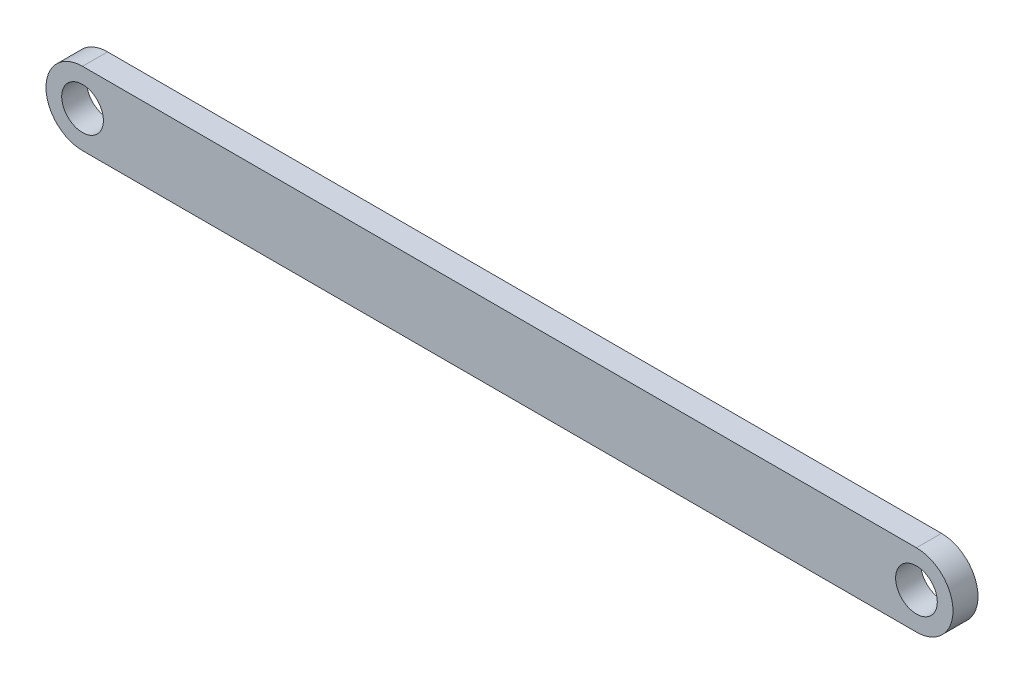
ISO-10303-21;
HEADER;
FILE_DESCRIPTION(('STEP AP214'),'2;1');
FILE_NAME('part.step','',(''),(''),'','','');
FILE_SCHEMA(('AUTOMOTIVE_DESIGN { 1 0 10303 214 1 1 1 1 }'));
ENDSEC;
DATA;
#1=APPLICATION_CONTEXT('core data for automotive mechanical design processes');
#2=APPLICATION_PROTOCOL_DEFINITION('international standard','automotive_design',2000,#1);
#3=PRODUCT_CONTEXT('',#1,'mechanical');
#4=PRODUCT('Part','Part','',(#3));
#5=PRODUCT_RELATED_PRODUCT_CATEGORY('part','',(#4));
#6=PRODUCT_DEFINITION_FORMATION('','',#4);
#7=PRODUCT_DEFINITION_CONTEXT('part definition',#1,'design');
#8=PRODUCT_DEFINITION('design','',#6,#7);
#9=PRODUCT_DEFINITION_SHAPE('','',#8);
#10=(LENGTH_UNIT() NAMED_UNIT(*) SI_UNIT(.MILLI.,.METRE.));
#11=(NAMED_UNIT(*) PLANE_ANGLE_UNIT() SI_UNIT($,.RADIAN.));
#12=(NAMED_UNIT(*) SI_UNIT($,.STERADIAN.) SOLID_ANGLE_UNIT());
#13=UNCERTAINTY_MEASURE_WITH_UNIT(LENGTH_MEASURE(1.E-05),#10,'distance_accuracy_value','');
#14=(GEOMETRIC_REPRESENTATION_CONTEXT(3) GLOBAL_UNCERTAINTY_ASSIGNED_CONTEXT((#13)) GLOBAL_UNIT_ASSIGNED_CONTEXT((#10,
#11,#12)) REPRESENTATION_CONTEXT('',''));
#15=CARTESIAN_POINT('',(0.,0.,0.));
#16=DIRECTION('',(0.,0.,1.));
#17=DIRECTION('',(1.,0.,0.));
#18=AXIS2_PLACEMENT_3D('',#15,#16,#17);
#19=CARTESIAN_POINT('',(-32.6751534027403,0.,6.));
#20=DIRECTION('',(0.,0.,1.));
#21=DIRECTION('',(1.,0.,0.));
#22=AXIS2_PLACEMENT_3D('',#19,#20,#21);
#23=PLANE('',#22);
#24=CARTESIAN_POINT('',(-32.6751534027403,0.,6.));
#25=DIRECTION('',(0.,0.,1.));
#26=DIRECTION('',(1.,0.,0.));
#27=AXIS2_PLACEMENT_3D('',#24,#25,#26);
#28=CIRCLE('',#27,5.);
#29=CARTESIAN_POINT('',(-27.6751534027403,0.,6.));
#30=VERTEX_POINT('',#29);
#31=EDGE_CURVE('E112',#30,#30,#28,.T.);
#32=ORIENTED_EDGE('',*,*,#31,.F.);
#33=EDGE_LOOP('',(#32));
#34=FACE_BOUND('',#33,.T.);
#35=CARTESIAN_POINT('',(-32.6751534027403,0.,6.));
#36=DIRECTION('',(0.,0.,1.));
#37=DIRECTION('',(1.,0.,0.));
#38=AXIS2_PLACEMENT_3D('',#35,#36,#37);
#39=CIRCLE('',#38,8.76308330597177);
#40=CARTESIAN_POINT('',(-32.6751534027403,8.76308330597177,6.));
#41=VERTEX_POINT('',#40);
#42=CARTESIAN_POINT('',(-32.6751534027403,-8.76308330597177,6.));
#43=VERTEX_POINT('',#42);
#44=EDGE_CURVE('E92',#41,#43,#39,.T.);
#45=ORIENTED_EDGE('',*,*,#44,.T.);
#46=DIRECTION('',(1.,0.,0.));
#47=VECTOR('',#46,1.);
#48=CARTESIAN_POINT('',(-32.6751534027403,-8.76308330597177,6.));
#49=LINE('',#48,#47);
#50=CARTESIAN_POINT('',(167.32484659726,-8.76308330597177,6.));
#51=VERTEX_POINT('',#50);
#52=EDGE_CURVE('E87',#43,#51,#49,.T.);
#53=ORIENTED_EDGE('',*,*,#52,.T.);
#54=CARTESIAN_POINT('',(167.32484659726,0.,6.));
#55=DIRECTION('',(0.,0.,1.));
#56=DIRECTION('',(1.,0.,0.));
#57=AXIS2_PLACEMENT_3D('',#54,#55,#56);
#58=CIRCLE('',#57,8.76308330597177);
#59=CARTESIAN_POINT('',(167.32484659726,8.76308330597177,6.));
#60=VERTEX_POINT('',#59);
#61=EDGE_CURVE('E90',#51,#60,#58,.T.);
#62=ORIENTED_EDGE('',*,*,#61,.T.);
#63=DIRECTION('',(-1.,0.,0.));
#64=VECTOR('',#63,1.);
#65=CARTESIAN_POINT('',(-32.6751534027403,8.76308330597177,6.));
#66=LINE('',#65,#64);
#67=EDGE_CURVE('E57',#60,#41,#66,.T.);
#68=ORIENTED_EDGE('',*,*,#67,.T.);
#69=EDGE_LOOP('',(#45,#53,#62,#68));
#70=FACE_BOUND('',#69,.T.);
#71=CARTESIAN_POINT('',(167.32484659726,0.,6.));
#72=DIRECTION('',(0.,0.,1.));
#73=DIRECTION('',(1.,0.,0.));
#74=AXIS2_PLACEMENT_3D('',#71,#72,#73);
#75=CIRCLE('',#74,5.00000000000002);
#76=CARTESIAN_POINT('',(172.32484659726,0.,6.));
#77=VERTEX_POINT('',#76);
#78=EDGE_CURVE('E134',#77,#77,#75,.T.);
#79=ORIENTED_EDGE('',*,*,#78,.F.);
#80=EDGE_LOOP('',(#79));
#81=FACE_BOUND('',#80,.T.);
#82=ADVANCED_FACE('F39',(#34,#70,#81),#23,.T.);
#83=CARTESIAN_POINT('',(-32.6751534027403,0.,0.));
#84=DIRECTION('',(0.,0.,1.));
#85=DIRECTION('',(1.,0.,0.));
#86=AXIS2_PLACEMENT_3D('',#83,#84,#85);
#87=PLANE('',#86);
#88=CARTESIAN_POINT('',(-32.6751534027403,0.,0.));
#89=DIRECTION('',(0.,0.,1.));
#90=DIRECTION('',(1.,0.,0.));
#91=AXIS2_PLACEMENT_3D('',#88,#89,#90);
#92=CIRCLE('',#91,8.76308330597177);
#93=CARTESIAN_POINT('',(-32.6751534027403,8.76308330597177,0.));
#94=VERTEX_POINT('',#93);
#95=CARTESIAN_POINT('',(-32.6751534027403,-8.76308330597177,0.));
#96=VERTEX_POINT('',#95);
#97=EDGE_CURVE('E108',#94,#96,#92,.T.);
#98=ORIENTED_EDGE('',*,*,#97,.F.);
#99=DIRECTION('',(-1.,0.,0.));
#100=VECTOR('',#99,1.);
#101=CARTESIAN_POINT('',(-32.6751534027403,8.76308330597177,0.));
#102=LINE('',#101,#100);
#103=CARTESIAN_POINT('',(167.32484659726,8.76308330597177,0.));
#104=VERTEX_POINT('',#103);
#105=EDGE_CURVE('E80',#104,#94,#102,.T.);
#106=ORIENTED_EDGE('',*,*,#105,.F.);
#107=CARTESIAN_POINT('',(167.32484659726,0.,0.));
#108=DIRECTION('',(0.,0.,1.));
#109=DIRECTION('',(1.,0.,0.));
#110=AXIS2_PLACEMENT_3D('',#107,#108,#109);
#111=CIRCLE('',#110,8.76308330597177);
#112=CARTESIAN_POINT('',(167.32484659726,-8.76308330597177,0.));
#113=VERTEX_POINT('',#112);
#114=EDGE_CURVE('E74',#113,#104,#111,.T.);
#115=ORIENTED_EDGE('',*,*,#114,.F.);
#116=DIRECTION('',(1.,0.,0.));
#117=VECTOR('',#116,1.);
#118=CARTESIAN_POINT('',(-32.6751534027403,-8.76308330597177,0.));
#119=LINE('',#118,#117);
#120=EDGE_CURVE('E97',#96,#113,#119,.T.);
#121=ORIENTED_EDGE('',*,*,#120,.F.);
#122=EDGE_LOOP('',(#98,#106,#115,#121));
#123=FACE_BOUND('',#122,.T.);
#124=CARTESIAN_POINT('',(-32.6751534027403,0.,0.));
#125=DIRECTION('',(0.,0.,1.));
#126=DIRECTION('',(1.,0.,0.));
#127=AXIS2_PLACEMENT_3D('',#124,#125,#126);
#128=CIRCLE('',#127,5.);
#129=CARTESIAN_POINT('',(-27.6751534027403,0.,0.));
#130=VERTEX_POINT('',#129);
#131=EDGE_CURVE('E130',#130,#130,#128,.T.);
#132=ORIENTED_EDGE('',*,*,#131,.T.);
#133=EDGE_LOOP('',(#132));
#134=FACE_BOUND('',#133,.T.);
#135=CARTESIAN_POINT('',(167.32484659726,0.,0.));
#136=DIRECTION('',(0.,0.,1.));
#137=DIRECTION('',(1.,0.,0.));
#138=AXIS2_PLACEMENT_3D('',#135,#136,#137);
#139=CIRCLE('',#138,5.00000000000002);
#140=CARTESIAN_POINT('',(172.32484659726,0.,0.));
#141=VERTEX_POINT('',#140);
#142=EDGE_CURVE('E138',#141,#141,#139,.T.);
#143=ORIENTED_EDGE('',*,*,#142,.T.);
#144=EDGE_LOOP('',(#143));
#145=FACE_BOUND('',#144,.T.);
#146=ADVANCED_FACE('F125',(#123,#134,#145),#87,.F.);
#147=CARTESIAN_POINT('',(-32.6751534027403,0.,6.));
#148=DIRECTION('',(0.,0.,-1.));
#149=DIRECTION('',(-1.,0.,0.));
#150=AXIS2_PLACEMENT_3D('',#147,#148,#149);
#151=CYLINDRICAL_SURFACE('',#150,8.76308330597177);
#152=ORIENTED_EDGE('',*,*,#97,.T.);
#153=DIRECTION('',(0.,0.,-1.));
#154=VECTOR('',#153,1.);
#155=CARTESIAN_POINT('',(-32.6751534027403,-8.76308330597177,6.));
#156=LINE('',#155,#154);
#157=EDGE_CURVE('E11',#43,#96,#156,.T.);
#158=ORIENTED_EDGE('',*,*,#157,.F.);
#159=ORIENTED_EDGE('',*,*,#44,.F.);
#160=DIRECTION('',(0.,0.,-1.));
#161=VECTOR('',#160,1.);
#162=CARTESIAN_POINT('',(-32.6751534027403,8.76308330597177,6.));
#163=LINE('',#162,#161);
#164=EDGE_CURVE('E104',#41,#94,#163,.T.);
#165=ORIENTED_EDGE('',*,*,#164,.T.);
#166=EDGE_LOOP('',(#152,#158,#159,#165));
#167=FACE_BOUND('',#166,.T.);
#168=ADVANCED_FACE('F41',(#167),#151,.T.);
#169=CARTESIAN_POINT('',(-32.6751534027403,-8.76308330597177,6.));
#170=DIRECTION('',(0.,1.,0.));
#171=DIRECTION('',(0.,0.,1.));
#172=AXIS2_PLACEMENT_3D('',#169,#170,#171);
#173=PLANE('',#172);
#174=ORIENTED_EDGE('',*,*,#120,.T.);
#175=DIRECTION('',(0.,0.,-1.));
#176=VECTOR('',#175,1.);
#177=CARTESIAN_POINT('',(167.32484659726,-8.76308330597177,6.));
#178=LINE('',#177,#176);
#179=EDGE_CURVE('E49',#51,#113,#178,.T.);
#180=ORIENTED_EDGE('',*,*,#179,.F.);
#181=ORIENTED_EDGE('',*,*,#52,.F.);
#182=ORIENTED_EDGE('',*,*,#157,.T.);
#183=EDGE_LOOP('',(#174,#180,#181,#182));
#184=FACE_BOUND('',#183,.T.);
#185=ADVANCED_FACE('F96',(#184),#173,.F.);
#186=CARTESIAN_POINT('',(167.32484659726,0.,6.));
#187=DIRECTION('',(0.,0.,-1.));
#188=DIRECTION('',(-1.,0.,0.));
#189=AXIS2_PLACEMENT_3D('',#186,#187,#188);
#190=CYLINDRICAL_SURFACE('',#189,8.76308330597177);
#191=ORIENTED_EDGE('',*,*,#114,.T.);
#192=DIRECTION('',(0.,0.,-1.));
#193=VECTOR('',#192,1.);
#194=CARTESIAN_POINT('',(167.32484659726,8.76308330597177,6.));
#195=LINE('',#194,#193);
#196=EDGE_CURVE('E99',#60,#104,#195,.T.);
#197=ORIENTED_EDGE('',*,*,#196,.F.);
#198=ORIENTED_EDGE('',*,*,#61,.F.);
#199=ORIENTED_EDGE('',*,*,#179,.T.);
#200=EDGE_LOOP('',(#191,#197,#198,#199));
#201=FACE_BOUND('',#200,.T.);
#202=ADVANCED_FACE('F100',(#201),#190,.T.);
#203=CARTESIAN_POINT('',(-32.6751534027403,8.76308330597177,6.));
#204=DIRECTION('',(0.,-1.,0.));
#205=DIRECTION('',(0.,0.,-1.));
#206=AXIS2_PLACEMENT_3D('',#203,#204,#205);
#207=PLANE('',#206);
#208=ORIENTED_EDGE('',*,*,#105,.T.);
#209=ORIENTED_EDGE('',*,*,#164,.F.);
#210=ORIENTED_EDGE('',*,*,#67,.F.);
#211=ORIENTED_EDGE('',*,*,#196,.T.);
#212=EDGE_LOOP('',(#208,#209,#210,#211));
#213=FACE_BOUND('',#212,.T.);
#214=ADVANCED_FACE('F122',(#213),#207,.F.);
#215=CARTESIAN_POINT('',(-32.6751534027403,0.,6.));
#216=DIRECTION('',(0.,0.,-1.));
#217=DIRECTION('',(-1.,0.,0.));
#218=AXIS2_PLACEMENT_3D('',#215,#216,#217);
#219=CYLINDRICAL_SURFACE('',#218,5.);
#220=ORIENTED_EDGE('',*,*,#31,.T.);
#221=EDGE_LOOP('',(#220));
#222=FACE_BOUND('',#221,.T.);
#223=ORIENTED_EDGE('',*,*,#131,.F.);
#224=EDGE_LOOP('',(#223));
#225=FACE_BOUND('',#224,.T.);
#226=ADVANCED_FACE('F157',(#222,#225),#219,.F.);
#227=CARTESIAN_POINT('',(167.32484659726,0.,6.));
#228=DIRECTION('',(0.,0.,-1.));
#229=DIRECTION('',(-1.,0.,0.));
#230=AXIS2_PLACEMENT_3D('',#227,#228,#229);
#231=CYLINDRICAL_SURFACE('',#230,5.00000000000002);
#232=ORIENTED_EDGE('',*,*,#78,.T.);
#233=EDGE_LOOP('',(#232));
#234=FACE_BOUND('',#233,.T.);
#235=ORIENTED_EDGE('',*,*,#142,.F.);
#236=EDGE_LOOP('',(#235));
#237=FACE_BOUND('',#236,.T.);
#238=ADVANCED_FACE('F146',(#234,#237),#231,.F.);
#239=CLOSED_SHELL('',(#82,#146,#168,#185,#202,#214,#226,#238));
#240=MANIFOLD_SOLID_BREP('B2',#239);
#241=ADVANCED_BREP_SHAPE_REPRESENTATION('',(#18,#240),#14);
#242=SHAPE_DEFINITION_REPRESENTATION(#9,#241);
ENDSEC;
END-ISO-10303-21;
